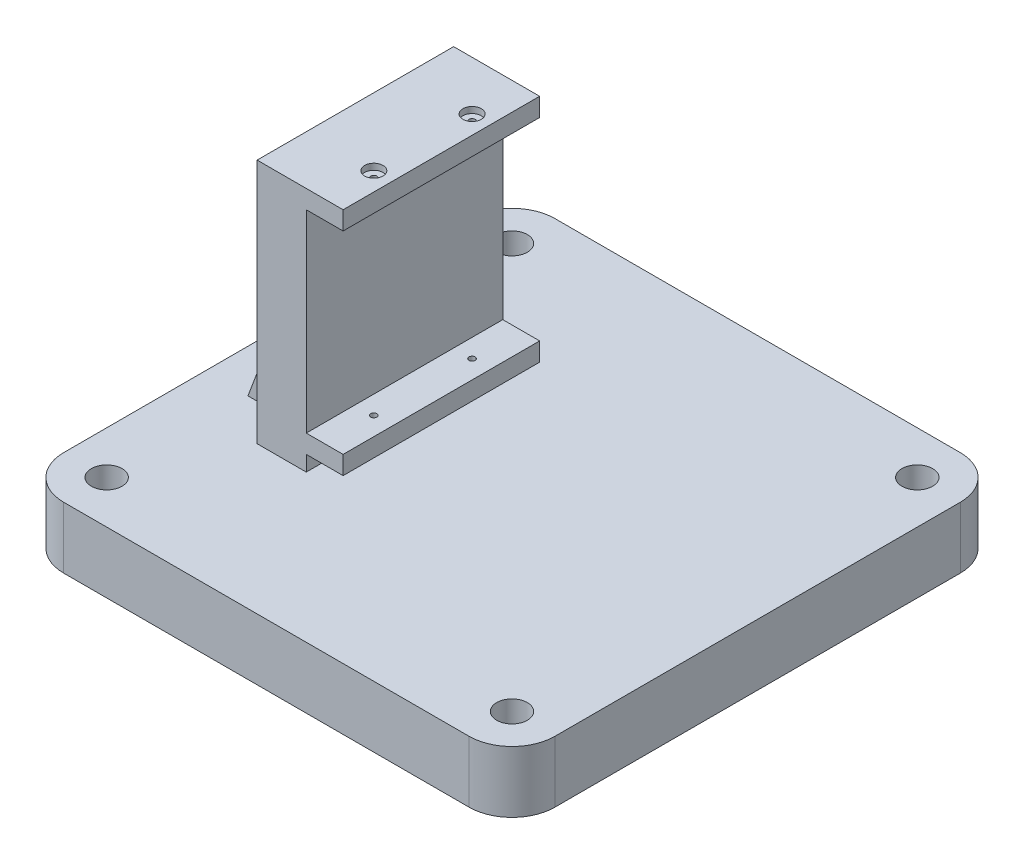
ISO-10303-21;
HEADER;
FILE_DESCRIPTION(('STEP AP214'),'2;1');
FILE_NAME('part.step','',(''),(''),'','','');
FILE_SCHEMA(('AUTOMOTIVE_DESIGN { 1 0 10303 214 1 1 1 1 }'));
ENDSEC;
DATA;
#1=APPLICATION_CONTEXT('core data for automotive mechanical design processes');
#2=APPLICATION_PROTOCOL_DEFINITION('international standard','automotive_design',2000,#1);
#3=PRODUCT_CONTEXT('',#1,'mechanical');
#4=PRODUCT('Part','Part','',(#3));
#5=PRODUCT_RELATED_PRODUCT_CATEGORY('part','',(#4));
#6=PRODUCT_DEFINITION_FORMATION('','',#4);
#7=PRODUCT_DEFINITION_CONTEXT('part definition',#1,'design');
#8=PRODUCT_DEFINITION('design','',#6,#7);
#9=PRODUCT_DEFINITION_SHAPE('','',#8);
#10=(LENGTH_UNIT() NAMED_UNIT(*) SI_UNIT(.MILLI.,.METRE.));
#11=(NAMED_UNIT(*) PLANE_ANGLE_UNIT() SI_UNIT($,.RADIAN.));
#12=(NAMED_UNIT(*) SI_UNIT($,.STERADIAN.) SOLID_ANGLE_UNIT());
#13=UNCERTAINTY_MEASURE_WITH_UNIT(LENGTH_MEASURE(1.E-05),#10,'distance_accuracy_value','');
#14=(GEOMETRIC_REPRESENTATION_CONTEXT(3) GLOBAL_UNCERTAINTY_ASSIGNED_CONTEXT((#13)) GLOBAL_UNIT_ASSIGNED_CONTEXT((#10,
#11,#12)) REPRESENTATION_CONTEXT('',''));
#15=CARTESIAN_POINT('',(0.,0.,0.));
#16=DIRECTION('',(0.,0.,1.));
#17=DIRECTION('',(1.,0.,0.));
#18=AXIS2_PLACEMENT_3D('',#15,#16,#17);
#19=CARTESIAN_POINT('',(-14.5,11.,-8.));
#20=DIRECTION('',(0.,1.,0.));
#21=DIRECTION('',(0.,0.,1.));
#22=AXIS2_PLACEMENT_3D('',#19,#20,#21);
#23=CYLINDRICAL_SURFACE('',#22,0.500000000000001);
#24=CARTESIAN_POINT('',(-14.5,47.,-8.));
#25=DIRECTION('',(0.,1.,0.));
#26=DIRECTION('',(0.,0.,1.));
#27=AXIS2_PLACEMENT_3D('',#24,#25,#26);
#28=CIRCLE('',#27,0.500000000000001);
#29=CARTESIAN_POINT('',(-14.5,47.,-7.5));
#30=VERTEX_POINT('',#29);
#31=EDGE_CURVE('E428',#30,#30,#28,.T.);
#32=ORIENTED_EDGE('',*,*,#31,.F.);
#33=EDGE_LOOP('',(#32));
#34=FACE_BOUND('',#33,.T.);
#35=CARTESIAN_POINT('',(-14.5,49.,-8.));
#36=DIRECTION('',(0.,1.,0.));
#37=DIRECTION('',(0.,0.,1.));
#38=AXIS2_PLACEMENT_3D('',#35,#36,#37);
#39=CIRCLE('',#38,0.500000000000001);
#40=CARTESIAN_POINT('',(-14.5,49.,-7.5));
#41=VERTEX_POINT('',#40);
#42=EDGE_CURVE('E43',#41,#41,#39,.F.);
#43=ORIENTED_EDGE('',*,*,#42,.F.);
#44=EDGE_LOOP('',(#43));
#45=FACE_BOUND('',#44,.T.);
#46=ADVANCED_FACE('F39',(#34,#45),#23,.F.);
#47=CARTESIAN_POINT('',(-14.5,11.,8.));
#48=DIRECTION('',(0.,1.,0.));
#49=DIRECTION('',(0.,0.,1.));
#50=AXIS2_PLACEMENT_3D('',#47,#48,#49);
#51=CYLINDRICAL_SURFACE('',#50,0.500000000000001);
#52=CARTESIAN_POINT('',(-14.5,47.,8.));
#53=DIRECTION('',(0.,1.,0.));
#54=DIRECTION('',(0.,0.,1.));
#55=AXIS2_PLACEMENT_3D('',#52,#53,#54);
#56=CIRCLE('',#55,0.500000000000001);
#57=CARTESIAN_POINT('',(-14.5,47.,8.5));
#58=VERTEX_POINT('',#57);
#59=EDGE_CURVE('E464',#58,#58,#56,.T.);
#60=ORIENTED_EDGE('',*,*,#59,.F.);
#61=EDGE_LOOP('',(#60));
#62=FACE_BOUND('',#61,.T.);
#63=CARTESIAN_POINT('',(-14.5,49.,8.));
#64=DIRECTION('',(0.,1.,0.));
#65=DIRECTION('',(0.,0.,1.));
#66=AXIS2_PLACEMENT_3D('',#63,#64,#65);
#67=CIRCLE('',#66,0.500000000000001);
#68=CARTESIAN_POINT('',(-14.5,49.,8.5));
#69=VERTEX_POINT('',#68);
#70=EDGE_CURVE('E429',#69,#69,#67,.F.);
#71=ORIENTED_EDGE('',*,*,#70,.F.);
#72=EDGE_LOOP('',(#71));
#73=FACE_BOUND('',#72,.T.);
#74=ADVANCED_FACE('F539',(#62,#73),#51,.F.);
#75=CARTESIAN_POINT('',(-17.5,50.,16.));
#76=DIRECTION('',(-1.,0.,0.));
#77=DIRECTION('',(0.,0.,1.));
#78=AXIS2_PLACEMENT_3D('',#75,#76,#77);
#79=PLANE('',#78);
#80=DIRECTION('',(0.,0.,-1.));
#81=VECTOR('',#80,1.);
#82=CARTESIAN_POINT('',(-17.5,12.5,16.));
#83=LINE('',#82,#81);
#84=CARTESIAN_POINT('',(-17.5,12.5,16.));
#85=VERTEX_POINT('',#84);
#86=CARTESIAN_POINT('',(-17.5,12.5,-16.));
#87=VERTEX_POINT('',#86);
#88=EDGE_CURVE('E467',#85,#87,#83,.T.);
#89=ORIENTED_EDGE('',*,*,#88,.F.);
#90=DIRECTION('',(0.,-1.,0.));
#91=VECTOR('',#90,1.);
#92=CARTESIAN_POINT('',(-17.5,50.,16.));
#93=LINE('',#92,#91);
#94=CARTESIAN_POINT('',(-17.5,10.,16.));
#95=VERTEX_POINT('',#94);
#96=EDGE_CURVE('E211',#85,#95,#93,.T.);
#97=ORIENTED_EDGE('',*,*,#96,.T.);
#98=DIRECTION('',(0.,0.,-1.));
#99=VECTOR('',#98,1.);
#100=CARTESIAN_POINT('',(-17.5,10.,16.));
#101=LINE('',#100,#99);
#102=CARTESIAN_POINT('',(-17.5,10.,-16.));
#103=VERTEX_POINT('',#102);
#104=EDGE_CURVE('E287',#95,#103,#101,.T.);
#105=ORIENTED_EDGE('',*,*,#104,.T.);
#106=DIRECTION('',(0.,-1.,0.));
#107=VECTOR('',#106,1.);
#108=CARTESIAN_POINT('',(-17.5,50.,-16.));
#109=LINE('',#108,#107);
#110=EDGE_CURVE('E57',#87,#103,#109,.T.);
#111=ORIENTED_EDGE('',*,*,#110,.F.);
#112=EDGE_LOOP('',(#89,#97,#105,#111));
#113=FACE_BOUND('',#112,.T.);
#114=ADVANCED_FACE('F515',(#113),#79,.F.);
#115=DIRECTION('',(0.,0.,1.));
#116=VECTOR('',#115,1.);
#117=CARTESIAN_POINT('',(-17.5,15.5,16.));
#118=LINE('',#117,#116);
#119=CARTESIAN_POINT('',(-17.5,15.5,-16.));
#120=VERTEX_POINT('',#119);
#121=CARTESIAN_POINT('',(-17.5,15.5,16.));
#122=VERTEX_POINT('',#121);
#123=EDGE_CURVE('E65',#120,#122,#118,.T.);
#124=ORIENTED_EDGE('',*,*,#123,.F.);
#125=CARTESIAN_POINT('',(-17.5,47.,-16.));
#126=VERTEX_POINT('',#125);
#127=EDGE_CURVE('E308',#126,#120,#109,.T.);
#128=ORIENTED_EDGE('',*,*,#127,.F.);
#129=DIRECTION('',(0.,0.,-1.));
#130=VECTOR('',#129,1.);
#131=CARTESIAN_POINT('',(-17.5,47.,16.));
#132=LINE('',#131,#130);
#133=CARTESIAN_POINT('',(-17.5,47.,16.));
#134=VERTEX_POINT('',#133);
#135=EDGE_CURVE('E213',#134,#126,#132,.T.);
#136=ORIENTED_EDGE('',*,*,#135,.F.);
#137=EDGE_CURVE('E305',#134,#122,#93,.T.);
#138=ORIENTED_EDGE('',*,*,#137,.T.);
#139=EDGE_LOOP('',(#124,#128,#136,#138));
#140=FACE_BOUND('',#139,.T.);
#141=ADVANCED_FACE('F490',(#140),#79,.F.);
#142=CARTESIAN_POINT('',(33.,10.,33.));
#143=DIRECTION('',(0.,1.,0.));
#144=DIRECTION('',(0.,0.,1.));
#145=AXIS2_PLACEMENT_3D('',#142,#143,#144);
#146=PLANE('',#145);
#147=DIRECTION('',(1.,0.,0.));
#148=VECTOR('',#147,1.);
#149=CARTESIAN_POINT('',(-25.5,10.,10.));
#150=LINE('',#149,#148);
#151=CARTESIAN_POINT('',(-33.,10.,10.));
#152=VERTEX_POINT('',#151);
#153=CARTESIAN_POINT('',(-25.5,10.,10.));
#154=VERTEX_POINT('',#153);
#155=EDGE_CURVE('E245',#152,#154,#150,.T.);
#156=ORIENTED_EDGE('',*,*,#155,.F.);
#157=DIRECTION('',(0.,0.,-1.));
#158=VECTOR('',#157,1.);
#159=CARTESIAN_POINT('',(-33.,10.,10.));
#160=LINE('',#159,#158);
#161=CARTESIAN_POINT('',(-33.,10.,-10.));
#162=VERTEX_POINT('',#161);
#163=EDGE_CURVE('E255',#152,#162,#160,.T.);
#164=ORIENTED_EDGE('',*,*,#163,.T.);
#165=DIRECTION('',(1.,0.,0.));
#166=VECTOR('',#165,1.);
#167=CARTESIAN_POINT('',(-25.5,10.,-10.));
#168=LINE('',#167,#166);
#169=CARTESIAN_POINT('',(-25.5,10.,-10.));
#170=VERTEX_POINT('',#169);
#171=EDGE_CURVE('E244',#162,#170,#168,.T.);
#172=ORIENTED_EDGE('',*,*,#171,.T.);
#173=DIRECTION('',(0.,0.,-1.));
#174=VECTOR('',#173,1.);
#175=CARTESIAN_POINT('',(-25.5,10.,16.));
#176=LINE('',#175,#174);
#177=CARTESIAN_POINT('',(-25.5,10.,-16.));
#178=VERTEX_POINT('',#177);
#179=EDGE_CURVE('E293',#170,#178,#176,.T.);
#180=ORIENTED_EDGE('',*,*,#179,.T.);
#181=DIRECTION('',(1.,0.,0.));
#182=VECTOR('',#181,1.);
#183=CARTESIAN_POINT('',(-25.5,10.,-16.));
#184=LINE('',#183,#182);
#185=EDGE_CURVE('E272',#178,#103,#184,.T.);
#186=ORIENTED_EDGE('',*,*,#185,.T.);
#187=ORIENTED_EDGE('',*,*,#104,.F.);
#188=DIRECTION('',(1.,0.,0.));
#189=VECTOR('',#188,1.);
#190=CARTESIAN_POINT('',(-25.5,10.,16.));
#191=LINE('',#190,#189);
#192=CARTESIAN_POINT('',(-25.5,10.,16.));
#193=VERTEX_POINT('',#192);
#194=EDGE_CURVE('E290',#193,#95,#191,.T.);
#195=ORIENTED_EDGE('',*,*,#194,.F.);
#196=EDGE_CURVE('E277',#193,#154,#176,.T.);
#197=ORIENTED_EDGE('',*,*,#196,.T.);
#198=EDGE_LOOP('',(#156,#164,#172,#180,#186,#187,#195,#197));
#199=FACE_BOUND('',#198,.T.);
#200=CARTESIAN_POINT('',(33.,10.,-33.));
#201=DIRECTION('',(0.,1.,0.));
#202=DIRECTION('',(0.,0.,-1.));
#203=AXIS2_PLACEMENT_3D('',#200,#201,#202);
#204=CIRCLE('',#203,2.5);
#205=CARTESIAN_POINT('',(33.,10.,-35.5));
#206=VERTEX_POINT('',#205);
#207=EDGE_CURVE('E319',#206,#206,#204,.T.);
#208=ORIENTED_EDGE('',*,*,#207,.F.);
#209=EDGE_LOOP('',(#208));
#210=FACE_BOUND('',#209,.T.);
#211=CARTESIAN_POINT('',(33.,10.,33.));
#212=DIRECTION('',(0.,1.,0.));
#213=DIRECTION('',(0.,0.,1.));
#214=AXIS2_PLACEMENT_3D('',#211,#212,#213);
#215=CIRCLE('',#214,2.5);
#216=CARTESIAN_POINT('',(33.,10.,35.5));
#217=VERTEX_POINT('',#216);
#218=EDGE_CURVE('E335',#217,#217,#215,.T.);
#219=ORIENTED_EDGE('',*,*,#218,.F.);
#220=EDGE_LOOP('',(#219));
#221=FACE_BOUND('',#220,.T.);
#222=CARTESIAN_POINT('',(33.,10.,33.));
#223=DIRECTION('',(0.,1.,0.));
#224=DIRECTION('',(0.,0.,1.));
#225=AXIS2_PLACEMENT_3D('',#222,#223,#224);
#226=CIRCLE('',#225,7.);
#227=CARTESIAN_POINT('',(33.,10.,40.));
#228=VERTEX_POINT('',#227);
#229=CARTESIAN_POINT('',(40.,10.,33.));
#230=VERTEX_POINT('',#229);
#231=EDGE_CURVE('E343',#228,#230,#226,.T.);
#232=ORIENTED_EDGE('',*,*,#231,.T.);
#233=DIRECTION('',(0.,0.,-1.));
#234=VECTOR('',#233,1.);
#235=CARTESIAN_POINT('',(40.,10.,33.));
#236=LINE('',#235,#234);
#237=CARTESIAN_POINT('',(40.,10.,-33.));
#238=VERTEX_POINT('',#237);
#239=EDGE_CURVE('E347',#230,#238,#236,.T.);
#240=ORIENTED_EDGE('',*,*,#239,.T.);
#241=CARTESIAN_POINT('',(33.,10.,-33.));
#242=DIRECTION('',(0.,1.,0.));
#243=DIRECTION('',(0.,0.,-1.));
#244=AXIS2_PLACEMENT_3D('',#241,#242,#243);
#245=CIRCLE('',#244,7.);
#246=CARTESIAN_POINT('',(33.,10.,-40.));
#247=VERTEX_POINT('',#246);
#248=EDGE_CURVE('E351',#238,#247,#245,.T.);
#249=ORIENTED_EDGE('',*,*,#248,.T.);
#250=DIRECTION('',(-1.,0.,0.));
#251=VECTOR('',#250,1.);
#252=CARTESIAN_POINT('',(-33.,10.,-40.));
#253=LINE('',#252,#251);
#254=CARTESIAN_POINT('',(-33.,10.,-40.));
#255=VERTEX_POINT('',#254);
#256=EDGE_CURVE('E354',#247,#255,#253,.T.);
#257=ORIENTED_EDGE('',*,*,#256,.T.);
#258=CARTESIAN_POINT('',(-33.,10.,-33.));
#259=DIRECTION('',(0.,1.,0.));
#260=DIRECTION('',(0.,0.,1.));
#261=AXIS2_PLACEMENT_3D('',#258,#259,#260);
#262=CIRCLE('',#261,7.);
#263=CARTESIAN_POINT('',(-40.,10.,-33.));
#264=VERTEX_POINT('',#263);
#265=EDGE_CURVE('E357',#255,#264,#262,.T.);
#266=ORIENTED_EDGE('',*,*,#265,.T.);
#267=DIRECTION('',(0.,0.,1.));
#268=VECTOR('',#267,1.);
#269=CARTESIAN_POINT('',(-40.,10.,33.));
#270=LINE('',#269,#268);
#271=CARTESIAN_POINT('',(-40.,10.,33.));
#272=VERTEX_POINT('',#271);
#273=EDGE_CURVE('E360',#264,#272,#270,.T.);
#274=ORIENTED_EDGE('',*,*,#273,.T.);
#275=CARTESIAN_POINT('',(-33.,10.,33.));
#276=DIRECTION('',(0.,1.,0.));
#277=DIRECTION('',(0.,0.,-1.));
#278=AXIS2_PLACEMENT_3D('',#275,#276,#277);
#279=CIRCLE('',#278,7.);
#280=CARTESIAN_POINT('',(-33.,10.,40.));
#281=VERTEX_POINT('',#280);
#282=EDGE_CURVE('E363',#272,#281,#279,.T.);
#283=ORIENTED_EDGE('',*,*,#282,.T.);
#284=DIRECTION('',(1.,0.,0.));
#285=VECTOR('',#284,1.);
#286=CARTESIAN_POINT('',(-33.,10.,40.));
#287=LINE('',#286,#285);
#288=EDGE_CURVE('E366',#281,#228,#287,.T.);
#289=ORIENTED_EDGE('',*,*,#288,.T.);
#290=EDGE_LOOP('',(#232,#240,#249,#257,#266,#274,#283,#289));
#291=FACE_BOUND('',#290,.T.);
#292=CARTESIAN_POINT('',(-33.,10.,33.));
#293=DIRECTION('',(0.,1.,0.));
#294=DIRECTION('',(0.,0.,-1.));
#295=AXIS2_PLACEMENT_3D('',#292,#293,#294);
#296=CIRCLE('',#295,2.5);
#297=CARTESIAN_POINT('',(-33.,10.,30.5));
#298=VERTEX_POINT('',#297);
#299=EDGE_CURVE('E327',#298,#298,#296,.T.);
#300=ORIENTED_EDGE('',*,*,#299,.F.);
#301=EDGE_LOOP('',(#300));
#302=FACE_BOUND('',#301,.T.);
#303=CARTESIAN_POINT('',(-33.,10.,-33.));
#304=DIRECTION('',(0.,1.,0.));
#305=DIRECTION('',(0.,0.,1.));
#306=AXIS2_PLACEMENT_3D('',#303,#304,#305);
#307=CIRCLE('',#306,2.5);
#308=CARTESIAN_POINT('',(-33.,10.,-30.5));
#309=VERTEX_POINT('',#308);
#310=EDGE_CURVE('E311',#309,#309,#307,.T.);
#311=ORIENTED_EDGE('',*,*,#310,.F.);
#312=EDGE_LOOP('',(#311));
#313=FACE_BOUND('',#312,.T.);
#314=ADVANCED_FACE('F513',(#199,#210,#221,#291,#302,#313),#146,.T.);
#315=CARTESIAN_POINT('',(33.,0.,33.));
#316=DIRECTION('',(0.,1.,0.));
#317=DIRECTION('',(0.,0.,1.));
#318=AXIS2_PLACEMENT_3D('',#315,#316,#317);
#319=PLANE('',#318);
#320=CARTESIAN_POINT('',(33.,0.,33.));
#321=DIRECTION('',(0.,1.,0.));
#322=DIRECTION('',(0.,0.,1.));
#323=AXIS2_PLACEMENT_3D('',#320,#321,#322);
#324=CIRCLE('',#323,7.);
#325=CARTESIAN_POINT('',(33.,0.,40.));
#326=VERTEX_POINT('',#325);
#327=CARTESIAN_POINT('',(40.,0.,33.));
#328=VERTEX_POINT('',#327);
#329=EDGE_CURVE('E339',#326,#328,#324,.T.);
#330=ORIENTED_EDGE('',*,*,#329,.F.);
#331=DIRECTION('',(1.,0.,0.));
#332=VECTOR('',#331,1.);
#333=CARTESIAN_POINT('',(-33.,0.,40.));
#334=LINE('',#333,#332);
#335=CARTESIAN_POINT('',(-33.,0.,40.));
#336=VERTEX_POINT('',#335);
#337=EDGE_CURVE('E348',#336,#326,#334,.T.);
#338=ORIENTED_EDGE('',*,*,#337,.F.);
#339=CARTESIAN_POINT('',(-33.,0.,33.));
#340=DIRECTION('',(0.,1.,0.));
#341=DIRECTION('',(0.,0.,-1.));
#342=AXIS2_PLACEMENT_3D('',#339,#340,#341);
#343=CIRCLE('',#342,7.);
#344=CARTESIAN_POINT('',(-40.,0.,33.));
#345=VERTEX_POINT('',#344);
#346=EDGE_CURVE('E388',#345,#336,#343,.T.);
#347=ORIENTED_EDGE('',*,*,#346,.F.);
#348=DIRECTION('',(0.,0.,1.));
#349=VECTOR('',#348,1.);
#350=CARTESIAN_POINT('',(-40.,0.,33.));
#351=LINE('',#350,#349);
#352=CARTESIAN_POINT('',(-40.,0.,-33.));
#353=VERTEX_POINT('',#352);
#354=EDGE_CURVE('E385',#353,#345,#351,.T.);
#355=ORIENTED_EDGE('',*,*,#354,.F.);
#356=CARTESIAN_POINT('',(-33.,0.,-33.));
#357=DIRECTION('',(0.,1.,0.));
#358=DIRECTION('',(0.,0.,1.));
#359=AXIS2_PLACEMENT_3D('',#356,#357,#358);
#360=CIRCLE('',#359,7.);
#361=CARTESIAN_POINT('',(-33.,0.,-40.));
#362=VERTEX_POINT('',#361);
#363=EDGE_CURVE('E382',#362,#353,#360,.T.);
#364=ORIENTED_EDGE('',*,*,#363,.F.);
#365=DIRECTION('',(-1.,0.,0.));
#366=VECTOR('',#365,1.);
#367=CARTESIAN_POINT('',(-33.,0.,-40.));
#368=LINE('',#367,#366);
#369=CARTESIAN_POINT('',(33.,0.,-40.));
#370=VERTEX_POINT('',#369);
#371=EDGE_CURVE('E379',#370,#362,#368,.T.);
#372=ORIENTED_EDGE('',*,*,#371,.F.);
#373=CARTESIAN_POINT('',(33.,0.,-33.));
#374=DIRECTION('',(0.,1.,0.));
#375=DIRECTION('',(0.,0.,-1.));
#376=AXIS2_PLACEMENT_3D('',#373,#374,#375);
#377=CIRCLE('',#376,7.);
#378=CARTESIAN_POINT('',(40.,0.,-33.));
#379=VERTEX_POINT('',#378);
#380=EDGE_CURVE('E376',#379,#370,#377,.T.);
#381=ORIENTED_EDGE('',*,*,#380,.F.);
#382=DIRECTION('',(0.,0.,-1.));
#383=VECTOR('',#382,1.);
#384=CARTESIAN_POINT('',(40.,0.,33.));
#385=LINE('',#384,#383);
#386=EDGE_CURVE('E373',#328,#379,#385,.T.);
#387=ORIENTED_EDGE('',*,*,#386,.F.);
#388=EDGE_LOOP('',(#330,#338,#347,#355,#364,#372,#381,#387));
#389=FACE_BOUND('',#388,.T.);
#390=CARTESIAN_POINT('',(33.,0.,33.));
#391=DIRECTION('',(0.,1.,0.));
#392=DIRECTION('',(0.,0.,1.));
#393=AXIS2_PLACEMENT_3D('',#390,#391,#392);
#394=CIRCLE('',#393,2.5);
#395=CARTESIAN_POINT('',(33.,0.,35.5));
#396=VERTEX_POINT('',#395);
#397=EDGE_CURVE('E331',#396,#396,#394,.T.);
#398=ORIENTED_EDGE('',*,*,#397,.T.);
#399=EDGE_LOOP('',(#398));
#400=FACE_BOUND('',#399,.T.);
#401=CARTESIAN_POINT('',(-33.,0.,33.));
#402=DIRECTION('',(0.,1.,0.));
#403=DIRECTION('',(0.,0.,-1.));
#404=AXIS2_PLACEMENT_3D('',#401,#402,#403);
#405=CIRCLE('',#404,2.5);
#406=CARTESIAN_POINT('',(-33.,0.,30.5));
#407=VERTEX_POINT('',#406);
#408=EDGE_CURVE('E323',#407,#407,#405,.T.);
#409=ORIENTED_EDGE('',*,*,#408,.T.);
#410=EDGE_LOOP('',(#409));
#411=FACE_BOUND('',#410,.T.);
#412=CARTESIAN_POINT('',(33.,0.,-33.));
#413=DIRECTION('',(0.,1.,0.));
#414=DIRECTION('',(0.,0.,-1.));
#415=AXIS2_PLACEMENT_3D('',#412,#413,#414);
#416=CIRCLE('',#415,2.5);
#417=CARTESIAN_POINT('',(33.,0.,-35.5));
#418=VERTEX_POINT('',#417);
#419=EDGE_CURVE('E315',#418,#418,#416,.T.);
#420=ORIENTED_EDGE('',*,*,#419,.T.);
#421=EDGE_LOOP('',(#420));
#422=FACE_BOUND('',#421,.T.);
#423=CARTESIAN_POINT('',(-33.,0.,-33.));
#424=DIRECTION('',(0.,1.,0.));
#425=DIRECTION('',(0.,0.,1.));
#426=AXIS2_PLACEMENT_3D('',#423,#424,#425);
#427=CIRCLE('',#426,2.5);
#428=CARTESIAN_POINT('',(-33.,0.,-30.5));
#429=VERTEX_POINT('',#428);
#430=EDGE_CURVE('E301',#429,#429,#427,.T.);
#431=ORIENTED_EDGE('',*,*,#430,.T.);
#432=EDGE_LOOP('',(#431));
#433=FACE_BOUND('',#432,.T.);
#434=ADVANCED_FACE('F755',(#389,#400,#411,#422,#433),#319,.F.);
#435=CARTESIAN_POINT('',(33.,10.,33.));
#436=DIRECTION('',(0.,-1.,0.));
#437=DIRECTION('',(0.,0.,-1.));
#438=AXIS2_PLACEMENT_3D('',#435,#436,#437);
#439=CYLINDRICAL_SURFACE('',#438,7.);
#440=ORIENTED_EDGE('',*,*,#329,.T.);
#441=DIRECTION('',(0.,-1.,0.));
#442=VECTOR('',#441,1.);
#443=CARTESIAN_POINT('',(40.,10.,33.));
#444=LINE('',#443,#442);
#445=EDGE_CURVE('E11',#230,#328,#444,.T.);
#446=ORIENTED_EDGE('',*,*,#445,.F.);
#447=ORIENTED_EDGE('',*,*,#231,.F.);
#448=DIRECTION('',(0.,-1.,0.));
#449=VECTOR('',#448,1.);
#450=CARTESIAN_POINT('',(33.,10.,40.));
#451=LINE('',#450,#449);
#452=EDGE_CURVE('E369',#228,#326,#451,.T.);
#453=ORIENTED_EDGE('',*,*,#452,.T.);
#454=EDGE_LOOP('',(#440,#446,#447,#453));
#455=FACE_BOUND('',#454,.T.);
#456=ADVANCED_FACE('F41',(#455),#439,.T.);
#457=CARTESIAN_POINT('',(40.,10.,33.));
#458=DIRECTION('',(-1.,0.,0.));
#459=DIRECTION('',(0.,0.,1.));
#460=AXIS2_PLACEMENT_3D('',#457,#458,#459);
#461=PLANE('',#460);
#462=ORIENTED_EDGE('',*,*,#386,.T.);
#463=DIRECTION('',(0.,-1.,0.));
#464=VECTOR('',#463,1.);
#465=CARTESIAN_POINT('',(40.,10.,-33.));
#466=LINE('',#465,#464);
#467=EDGE_CURVE('E49',#238,#379,#466,.T.);
#468=ORIENTED_EDGE('',*,*,#467,.F.);
#469=ORIENTED_EDGE('',*,*,#239,.F.);
#470=ORIENTED_EDGE('',*,*,#445,.T.);
#471=EDGE_LOOP('',(#462,#468,#469,#470));
#472=FACE_BOUND('',#471,.T.);
#473=ADVANCED_FACE('F780',(#472),#461,.F.);
#474=CARTESIAN_POINT('',(33.,10.,-33.));
#475=DIRECTION('',(0.,-1.,0.));
#476=DIRECTION('',(0.,0.,-1.));
#477=AXIS2_PLACEMENT_3D('',#474,#475,#476);
#478=CYLINDRICAL_SURFACE('',#477,7.);
#479=ORIENTED_EDGE('',*,*,#380,.T.);
#480=DIRECTION('',(0.,-1.,0.));
#481=VECTOR('',#480,1.);
#482=CARTESIAN_POINT('',(33.,10.,-40.));
#483=LINE('',#482,#481);
#484=EDGE_CURVE('E412',#247,#370,#483,.T.);
#485=ORIENTED_EDGE('',*,*,#484,.F.);
#486=ORIENTED_EDGE('',*,*,#248,.F.);
#487=ORIENTED_EDGE('',*,*,#467,.T.);
#488=EDGE_LOOP('',(#479,#485,#486,#487));
#489=FACE_BOUND('',#488,.T.);
#490=ADVANCED_FACE('F777',(#489),#478,.T.);
#491=CARTESIAN_POINT('',(-33.,10.,-40.));
#492=DIRECTION('',(0.,0.,1.));
#493=DIRECTION('',(1.,0.,0.));
#494=AXIS2_PLACEMENT_3D('',#491,#492,#493);
#495=PLANE('',#494);
#496=ORIENTED_EDGE('',*,*,#371,.T.);
#497=DIRECTION('',(0.,-1.,0.));
#498=VECTOR('',#497,1.);
#499=CARTESIAN_POINT('',(-33.,10.,-40.));
#500=LINE('',#499,#498);
#501=EDGE_CURVE('E408',#255,#362,#500,.T.);
#502=ORIENTED_EDGE('',*,*,#501,.F.);
#503=ORIENTED_EDGE('',*,*,#256,.F.);
#504=ORIENTED_EDGE('',*,*,#484,.T.);
#505=EDGE_LOOP('',(#496,#502,#503,#504));
#506=FACE_BOUND('',#505,.T.);
#507=ADVANCED_FACE('F773',(#506),#495,.F.);
#508=CARTESIAN_POINT('',(-33.,10.,-33.));
#509=DIRECTION('',(0.,-1.,0.));
#510=DIRECTION('',(0.,0.,-1.));
#511=AXIS2_PLACEMENT_3D('',#508,#509,#510);
#512=CYLINDRICAL_SURFACE('',#511,7.);
#513=ORIENTED_EDGE('',*,*,#363,.T.);
#514=DIRECTION('',(0.,-1.,0.));
#515=VECTOR('',#514,1.);
#516=CARTESIAN_POINT('',(-40.,10.,-33.));
#517=LINE('',#516,#515);
#518=EDGE_CURVE('E404',#264,#353,#517,.T.);
#519=ORIENTED_EDGE('',*,*,#518,.F.);
#520=ORIENTED_EDGE('',*,*,#265,.F.);
#521=ORIENTED_EDGE('',*,*,#501,.T.);
#522=EDGE_LOOP('',(#513,#519,#520,#521));
#523=FACE_BOUND('',#522,.T.);
#524=ADVANCED_FACE('F769',(#523),#512,.T.);
#525=CARTESIAN_POINT('',(-40.,10.,33.));
#526=DIRECTION('',(1.,0.,0.));
#527=DIRECTION('',(0.,0.,-1.));
#528=AXIS2_PLACEMENT_3D('',#525,#526,#527);
#529=PLANE('',#528);
#530=ORIENTED_EDGE('',*,*,#354,.T.);
#531=DIRECTION('',(0.,-1.,0.));
#532=VECTOR('',#531,1.);
#533=CARTESIAN_POINT('',(-40.,10.,33.));
#534=LINE('',#533,#532);
#535=EDGE_CURVE('E400',#272,#345,#534,.T.);
#536=ORIENTED_EDGE('',*,*,#535,.F.);
#537=ORIENTED_EDGE('',*,*,#273,.F.);
#538=ORIENTED_EDGE('',*,*,#518,.T.);
#539=EDGE_LOOP('',(#530,#536,#537,#538));
#540=FACE_BOUND('',#539,.T.);
#541=ADVANCED_FACE('F765',(#540),#529,.F.);
#542=CARTESIAN_POINT('',(-33.,10.,33.));
#543=DIRECTION('',(0.,-1.,0.));
#544=DIRECTION('',(0.,0.,-1.));
#545=AXIS2_PLACEMENT_3D('',#542,#543,#544);
#546=CYLINDRICAL_SURFACE('',#545,7.);
#547=ORIENTED_EDGE('',*,*,#346,.T.);
#548=DIRECTION('',(0.,-1.,0.));
#549=VECTOR('',#548,1.);
#550=CARTESIAN_POINT('',(-33.,10.,40.));
#551=LINE('',#550,#549);
#552=EDGE_CURVE('E396',#281,#336,#551,.T.);
#553=ORIENTED_EDGE('',*,*,#552,.F.);
#554=ORIENTED_EDGE('',*,*,#282,.F.);
#555=ORIENTED_EDGE('',*,*,#535,.T.);
#556=EDGE_LOOP('',(#547,#553,#554,#555));
#557=FACE_BOUND('',#556,.T.);
#558=ADVANCED_FACE('F761',(#557),#546,.T.);
#559=CARTESIAN_POINT('',(-33.,10.,40.));
#560=DIRECTION('',(0.,0.,-1.));
#561=DIRECTION('',(-1.,0.,0.));
#562=AXIS2_PLACEMENT_3D('',#559,#560,#561);
#563=PLANE('',#562);
#564=ORIENTED_EDGE('',*,*,#337,.T.);
#565=ORIENTED_EDGE('',*,*,#452,.F.);
#566=ORIENTED_EDGE('',*,*,#288,.F.);
#567=ORIENTED_EDGE('',*,*,#552,.T.);
#568=EDGE_LOOP('',(#564,#565,#566,#567));
#569=FACE_BOUND('',#568,.T.);
#570=ADVANCED_FACE('F752',(#569),#563,.F.);
#571=CARTESIAN_POINT('',(33.,10.,33.));
#572=DIRECTION('',(0.,-1.,0.));
#573=DIRECTION('',(0.,0.,-1.));
#574=AXIS2_PLACEMENT_3D('',#571,#572,#573);
#575=CYLINDRICAL_SURFACE('',#574,2.5);
#576=ORIENTED_EDGE('',*,*,#218,.T.);
#577=EDGE_LOOP('',(#576));
#578=FACE_BOUND('',#577,.T.);
#579=ORIENTED_EDGE('',*,*,#397,.F.);
#580=EDGE_LOOP('',(#579));
#581=FACE_BOUND('',#580,.T.);
#582=ADVANCED_FACE('F748',(#578,#581),#575,.F.);
#583=CARTESIAN_POINT('',(-33.,10.,33.));
#584=DIRECTION('',(0.,-1.,0.));
#585=DIRECTION('',(0.,0.,-1.));
#586=AXIS2_PLACEMENT_3D('',#583,#584,#585);
#587=CYLINDRICAL_SURFACE('',#586,2.5);
#588=ORIENTED_EDGE('',*,*,#299,.T.);
#589=EDGE_LOOP('',(#588));
#590=FACE_BOUND('',#589,.T.);
#591=ORIENTED_EDGE('',*,*,#408,.F.);
#592=EDGE_LOOP('',(#591));
#593=FACE_BOUND('',#592,.T.);
#594=ADVANCED_FACE('F744',(#590,#593),#587,.F.);
#595=CARTESIAN_POINT('',(33.,10.,-33.));
#596=DIRECTION('',(0.,-1.,0.));
#597=DIRECTION('',(0.,0.,-1.));
#598=AXIS2_PLACEMENT_3D('',#595,#596,#597);
#599=CYLINDRICAL_SURFACE('',#598,2.5);
#600=ORIENTED_EDGE('',*,*,#207,.T.);
#601=EDGE_LOOP('',(#600));
#602=FACE_BOUND('',#601,.T.);
#603=ORIENTED_EDGE('',*,*,#419,.F.);
#604=EDGE_LOOP('',(#603));
#605=FACE_BOUND('',#604,.T.);
#606=ADVANCED_FACE('F741',(#602,#605),#599,.F.);
#607=CARTESIAN_POINT('',(-33.,10.,-33.));
#608=DIRECTION('',(0.,-1.,0.));
#609=DIRECTION('',(0.,0.,-1.));
#610=AXIS2_PLACEMENT_3D('',#607,#608,#609);
#611=CYLINDRICAL_SURFACE('',#610,2.5);
#612=ORIENTED_EDGE('',*,*,#310,.T.);
#613=EDGE_LOOP('',(#612));
#614=FACE_BOUND('',#613,.T.);
#615=ORIENTED_EDGE('',*,*,#430,.F.);
#616=EDGE_LOOP('',(#615));
#617=FACE_BOUND('',#616,.T.);
#618=ADVANCED_FACE('F726',(#614,#617),#611,.F.);
#619=CARTESIAN_POINT('',(-25.5,50.,-16.));
#620=DIRECTION('',(0.,0.,-1.));
#621=DIRECTION('',(-1.,0.,0.));
#622=AXIS2_PLACEMENT_3D('',#619,#620,#621);
#623=PLANE('',#622);
#624=ORIENTED_EDGE('',*,*,#185,.F.);
#625=DIRECTION('',(0.,-1.,0.));
#626=VECTOR('',#625,1.);
#627=CARTESIAN_POINT('',(-25.5,50.,-16.));
#628=LINE('',#627,#626);
#629=CARTESIAN_POINT('',(-25.5,50.,-16.));
#630=VERTEX_POINT('',#629);
#631=EDGE_CURVE('E297',#630,#178,#628,.T.);
#632=ORIENTED_EDGE('',*,*,#631,.F.);
#633=DIRECTION('',(1.,0.,0.));
#634=VECTOR('',#633,1.);
#635=CARTESIAN_POINT('',(-25.5,50.,-16.));
#636=LINE('',#635,#634);
#637=CARTESIAN_POINT('',(-11.5,50.,-16.));
#638=VERTEX_POINT('',#637);
#639=EDGE_CURVE('E273',#630,#638,#636,.T.);
#640=ORIENTED_EDGE('',*,*,#639,.T.);
#641=DIRECTION('',(0.,1.,0.));
#642=VECTOR('',#641,1.);
#643=CARTESIAN_POINT('',(-11.5,50.,-16.));
#644=LINE('',#643,#642);
#645=CARTESIAN_POINT('',(-11.5,47.,-16.));
#646=VERTEX_POINT('',#645);
#647=EDGE_CURVE('E229',#646,#638,#644,.T.);
#648=ORIENTED_EDGE('',*,*,#647,.F.);
#649=DIRECTION('',(-1.,0.,0.));
#650=VECTOR('',#649,1.);
#651=CARTESIAN_POINT('',(-11.5,47.,-16.));
#652=LINE('',#651,#650);
#653=EDGE_CURVE('E236',#646,#126,#652,.T.);
#654=ORIENTED_EDGE('',*,*,#653,.T.);
#655=ORIENTED_EDGE('',*,*,#127,.T.);
#656=DIRECTION('',(-1.,0.,0.));
#657=VECTOR('',#656,1.);
#658=CARTESIAN_POINT('',(-11.5,15.5,-16.));
#659=LINE('',#658,#657);
#660=CARTESIAN_POINT('',(-11.5,15.5,-16.));
#661=VERTEX_POINT('',#660);
#662=EDGE_CURVE('E219',#661,#120,#659,.T.);
#663=ORIENTED_EDGE('',*,*,#662,.F.);
#664=DIRECTION('',(0.,1.,0.));
#665=VECTOR('',#664,1.);
#666=CARTESIAN_POINT('',(-11.5,15.5,-16.));
#667=LINE('',#666,#665);
#668=CARTESIAN_POINT('',(-11.5,12.5,-16.));
#669=VERTEX_POINT('',#668);
#670=EDGE_CURVE('E197',#669,#661,#667,.T.);
#671=ORIENTED_EDGE('',*,*,#670,.F.);
#672=DIRECTION('',(-1.,0.,0.));
#673=VECTOR('',#672,1.);
#674=CARTESIAN_POINT('',(-11.5,12.5,-16.));
#675=LINE('',#674,#673);
#676=EDGE_CURVE('E193',#669,#87,#675,.T.);
#677=ORIENTED_EDGE('',*,*,#676,.T.);
#678=ORIENTED_EDGE('',*,*,#110,.T.);
#679=EDGE_LOOP('',(#624,#632,#640,#648,#654,#655,#663,#671,#677,#678));
#680=FACE_BOUND('',#679,.T.);
#681=ADVANCED_FACE('F486',(#680),#623,.T.);
#682=CARTESIAN_POINT('',(-25.5,50.,16.));
#683=DIRECTION('',(-1.,0.,0.));
#684=DIRECTION('',(0.,0.,1.));
#685=AXIS2_PLACEMENT_3D('',#682,#683,#684);
#686=PLANE('',#685);
#687=DIRECTION('',(0.,1.,0.));
#688=VECTOR('',#687,1.);
#689=CARTESIAN_POINT('',(-25.5,30.,10.));
#690=LINE('',#689,#688);
#691=CARTESIAN_POINT('',(-25.5,30.,10.));
#692=VERTEX_POINT('',#691);
#693=EDGE_CURVE('E248',#154,#692,#690,.T.);
#694=ORIENTED_EDGE('',*,*,#693,.F.);
#695=ORIENTED_EDGE('',*,*,#196,.F.);
#696=DIRECTION('',(0.,-1.,0.));
#697=VECTOR('',#696,1.);
#698=CARTESIAN_POINT('',(-25.5,50.,16.));
#699=LINE('',#698,#697);
#700=CARTESIAN_POINT('',(-25.5,50.,16.));
#701=VERTEX_POINT('',#700);
#702=EDGE_CURVE('E302',#701,#193,#699,.T.);
#703=ORIENTED_EDGE('',*,*,#702,.F.);
#704=DIRECTION('',(0.,0.,-1.));
#705=VECTOR('',#704,1.);
#706=CARTESIAN_POINT('',(-25.5,50.,16.));
#707=LINE('',#706,#705);
#708=EDGE_CURVE('E280',#701,#630,#707,.T.);
#709=ORIENTED_EDGE('',*,*,#708,.T.);
#710=ORIENTED_EDGE('',*,*,#631,.T.);
#711=ORIENTED_EDGE('',*,*,#179,.F.);
#712=DIRECTION('',(0.,1.,0.));
#713=VECTOR('',#712,1.);
#714=CARTESIAN_POINT('',(-25.5,30.,-10.));
#715=LINE('',#714,#713);
#716=CARTESIAN_POINT('',(-25.5,30.,-10.));
#717=VERTEX_POINT('',#716);
#718=EDGE_CURVE('E259',#170,#717,#715,.T.);
#719=ORIENTED_EDGE('',*,*,#718,.T.);
#720=DIRECTION('',(0.,0.,-1.));
#721=VECTOR('',#720,1.);
#722=CARTESIAN_POINT('',(-25.5,30.,10.));
#723=LINE('',#722,#721);
#724=EDGE_CURVE('E268',#692,#717,#723,.T.);
#725=ORIENTED_EDGE('',*,*,#724,.F.);
#726=EDGE_LOOP('',(#694,#695,#703,#709,#710,#711,#719,#725));
#727=FACE_BOUND('',#726,.T.);
#728=ADVANCED_FACE('F509',(#727),#686,.T.);
#729=CARTESIAN_POINT('',(-25.5,50.,16.));
#730=DIRECTION('',(0.,0.,-1.));
#731=DIRECTION('',(-1.,0.,0.));
#732=AXIS2_PLACEMENT_3D('',#729,#730,#731);
#733=PLANE('',#732);
#734=ORIENTED_EDGE('',*,*,#194,.T.);
#735=ORIENTED_EDGE('',*,*,#96,.F.);
#736=DIRECTION('',(-1.,0.,0.));
#737=VECTOR('',#736,1.);
#738=CARTESIAN_POINT('',(-11.5,12.5,16.));
#739=LINE('',#738,#737);
#740=CARTESIAN_POINT('',(-11.5,12.5,16.));
#741=VERTEX_POINT('',#740);
#742=EDGE_CURVE('E191',#741,#85,#739,.T.);
#743=ORIENTED_EDGE('',*,*,#742,.F.);
#744=DIRECTION('',(0.,-1.,0.));
#745=VECTOR('',#744,1.);
#746=CARTESIAN_POINT('',(-11.5,15.5,16.));
#747=LINE('',#746,#745);
#748=CARTESIAN_POINT('',(-11.5,15.5,16.));
#749=VERTEX_POINT('',#748);
#750=EDGE_CURVE('E198',#749,#741,#747,.T.);
#751=ORIENTED_EDGE('',*,*,#750,.F.);
#752=DIRECTION('',(-1.,0.,0.));
#753=VECTOR('',#752,1.);
#754=CARTESIAN_POINT('',(-11.5,15.5,16.));
#755=LINE('',#754,#753);
#756=EDGE_CURVE('E473',#749,#122,#755,.T.);
#757=ORIENTED_EDGE('',*,*,#756,.T.);
#758=ORIENTED_EDGE('',*,*,#137,.F.);
#759=DIRECTION('',(-1.,0.,0.));
#760=VECTOR('',#759,1.);
#761=CARTESIAN_POINT('',(-11.5,47.,16.));
#762=LINE('',#761,#760);
#763=CARTESIAN_POINT('',(-11.5,47.,16.));
#764=VERTEX_POINT('',#763);
#765=EDGE_CURVE('E241',#764,#134,#762,.T.);
#766=ORIENTED_EDGE('',*,*,#765,.F.);
#767=DIRECTION('',(0.,-1.,0.));
#768=VECTOR('',#767,1.);
#769=CARTESIAN_POINT('',(-11.5,50.,16.));
#770=LINE('',#769,#768);
#771=CARTESIAN_POINT('',(-11.5,50.,16.));
#772=VERTEX_POINT('',#771);
#773=EDGE_CURVE('E217',#772,#764,#770,.T.);
#774=ORIENTED_EDGE('',*,*,#773,.F.);
#775=DIRECTION('',(1.,0.,0.));
#776=VECTOR('',#775,1.);
#777=CARTESIAN_POINT('',(-25.5,50.,16.));
#778=LINE('',#777,#776);
#779=EDGE_CURVE('E276',#701,#772,#778,.T.);
#780=ORIENTED_EDGE('',*,*,#779,.F.);
#781=ORIENTED_EDGE('',*,*,#702,.T.);
#782=EDGE_LOOP('',(#734,#735,#743,#751,#757,#758,#766,#774,#780,#781));
#783=FACE_BOUND('',#782,.T.);
#784=ADVANCED_FACE('F210',(#783),#733,.F.);
#785=CARTESIAN_POINT('',(0.,50.,0.));
#786=DIRECTION('',(0.,1.,0.));
#787=DIRECTION('',(0.,0.,1.));
#788=AXIS2_PLACEMENT_3D('',#785,#786,#787);
#789=PLANE('',#788);
#790=CARTESIAN_POINT('',(-14.5,50.,-8.));
#791=DIRECTION('',(0.,1.,0.));
#792=DIRECTION('',(0.,0.,1.));
#793=AXIS2_PLACEMENT_3D('',#790,#791,#792);
#794=CIRCLE('',#793,1.5);
#795=CARTESIAN_POINT('',(-14.5,50.,-6.5));
#796=VERTEX_POINT('',#795);
#797=EDGE_CURVE('E439',#796,#796,#794,.T.);
#798=ORIENTED_EDGE('',*,*,#797,.F.);
#799=EDGE_LOOP('',(#798));
#800=FACE_BOUND('',#799,.T.);
#801=CARTESIAN_POINT('',(-14.5,50.,8.));
#802=DIRECTION('',(0.,1.,0.));
#803=DIRECTION('',(0.,0.,1.));
#804=AXIS2_PLACEMENT_3D('',#801,#802,#803);
#805=CIRCLE('',#804,1.5);
#806=CARTESIAN_POINT('',(-14.5,50.,9.5));
#807=VERTEX_POINT('',#806);
#808=EDGE_CURVE('E451',#807,#807,#805,.T.);
#809=ORIENTED_EDGE('',*,*,#808,.F.);
#810=EDGE_LOOP('',(#809));
#811=FACE_BOUND('',#810,.T.);
#812=ORIENTED_EDGE('',*,*,#639,.F.);
#813=ORIENTED_EDGE('',*,*,#708,.F.);
#814=ORIENTED_EDGE('',*,*,#779,.T.);
#815=DIRECTION('',(0.,0.,1.));
#816=VECTOR('',#815,1.);
#817=CARTESIAN_POINT('',(-11.5,50.,16.));
#818=LINE('',#817,#816);
#819=EDGE_CURVE('E233',#638,#772,#818,.T.);
#820=ORIENTED_EDGE('',*,*,#819,.F.);
#821=EDGE_LOOP('',(#812,#813,#814,#820));
#822=FACE_BOUND('',#821,.T.);
#823=ADVANCED_FACE('F502',(#800,#811,#822),#789,.T.);
#824=CARTESIAN_POINT('',(-33.,10.,10.));
#825=DIRECTION('',(0.936329177569044,-0.351123441588392,0.));
#826=DIRECTION('',(0.351123441588392,0.936329177569045,0.));
#827=AXIS2_PLACEMENT_3D('',#824,#825,#826);
#828=PLANE('',#827);
#829=DIRECTION('',(-0.351123441588392,-0.936329177569044,0.));
#830=VECTOR('',#829,1.);
#831=CARTESIAN_POINT('',(-33.,10.,-10.));
#832=LINE('',#831,#830);
#833=EDGE_CURVE('E249',#717,#162,#832,.T.);
#834=ORIENTED_EDGE('',*,*,#833,.T.);
#835=ORIENTED_EDGE('',*,*,#163,.F.);
#836=DIRECTION('',(-0.351123441588392,-0.936329177569044,0.));
#837=VECTOR('',#836,1.);
#838=CARTESIAN_POINT('',(-33.,10.,10.));
#839=LINE('',#838,#837);
#840=EDGE_CURVE('E252',#692,#152,#839,.T.);
#841=ORIENTED_EDGE('',*,*,#840,.F.);
#842=ORIENTED_EDGE('',*,*,#724,.T.);
#843=EDGE_LOOP('',(#834,#835,#841,#842));
#844=FACE_BOUND('',#843,.T.);
#845=ADVANCED_FACE('F526',(#844),#828,.F.);
#846=CARTESIAN_POINT('',(0.,0.,10.));
#847=DIRECTION('',(0.,0.,1.));
#848=DIRECTION('',(1.,0.,0.));
#849=AXIS2_PLACEMENT_3D('',#846,#847,#848);
#850=PLANE('',#849);
#851=ORIENTED_EDGE('',*,*,#155,.T.);
#852=ORIENTED_EDGE('',*,*,#693,.T.);
#853=ORIENTED_EDGE('',*,*,#840,.T.);
#854=EDGE_LOOP('',(#851,#852,#853));
#855=FACE_BOUND('',#854,.T.);
#856=ADVANCED_FACE('F528',(#855),#850,.T.);
#857=CARTESIAN_POINT('',(0.,0.,-10.));
#858=DIRECTION('',(0.,0.,1.));
#859=DIRECTION('',(1.,0.,0.));
#860=AXIS2_PLACEMENT_3D('',#857,#858,#859);
#861=PLANE('',#860);
#862=ORIENTED_EDGE('',*,*,#171,.F.);
#863=ORIENTED_EDGE('',*,*,#833,.F.);
#864=ORIENTED_EDGE('',*,*,#718,.F.);
#865=EDGE_LOOP('',(#862,#863,#864));
#866=FACE_BOUND('',#865,.T.);
#867=ADVANCED_FACE('F522',(#866),#861,.F.);
#868=CARTESIAN_POINT('',(-11.5,47.,16.));
#869=DIRECTION('',(0.,1.,0.));
#870=DIRECTION('',(0.,0.,1.));
#871=AXIS2_PLACEMENT_3D('',#868,#869,#870);
#872=PLANE('',#871);
#873=ORIENTED_EDGE('',*,*,#59,.T.);
#874=EDGE_LOOP('',(#873));
#875=FACE_BOUND('',#874,.T.);
#876=ORIENTED_EDGE('',*,*,#31,.T.);
#877=EDGE_LOOP('',(#876));
#878=FACE_BOUND('',#877,.T.);
#879=ORIENTED_EDGE('',*,*,#135,.T.);
#880=ORIENTED_EDGE('',*,*,#653,.F.);
#881=DIRECTION('',(0.,0.,-1.));
#882=VECTOR('',#881,1.);
#883=CARTESIAN_POINT('',(-11.5,47.,16.));
#884=LINE('',#883,#882);
#885=EDGE_CURVE('E226',#764,#646,#884,.T.);
#886=ORIENTED_EDGE('',*,*,#885,.F.);
#887=ORIENTED_EDGE('',*,*,#765,.T.);
#888=EDGE_LOOP('',(#879,#880,#886,#887));
#889=FACE_BOUND('',#888,.T.);
#890=ADVANCED_FACE('F496',(#875,#878,#889),#872,.F.);
#891=CARTESIAN_POINT('',(-11.5,0.,0.));
#892=DIRECTION('',(1.,0.,0.));
#893=DIRECTION('',(0.,0.,-1.));
#894=AXIS2_PLACEMENT_3D('',#891,#892,#893);
#895=PLANE('',#894);
#896=ORIENTED_EDGE('',*,*,#773,.T.);
#897=ORIENTED_EDGE('',*,*,#885,.T.);
#898=ORIENTED_EDGE('',*,*,#647,.T.);
#899=ORIENTED_EDGE('',*,*,#819,.T.);
#900=EDGE_LOOP('',(#896,#897,#898,#899));
#901=FACE_BOUND('',#900,.T.);
#902=ADVANCED_FACE('F498',(#901),#895,.T.);
#903=CARTESIAN_POINT('',(-11.5,12.5,16.));
#904=DIRECTION('',(0.,1.,0.));
#905=DIRECTION('',(0.,0.,1.));
#906=AXIS2_PLACEMENT_3D('',#903,#904,#905);
#907=PLANE('',#906);
#908=CARTESIAN_POINT('',(-14.5,12.5,8.));
#909=DIRECTION('',(0.,1.,0.));
#910=DIRECTION('',(0.,0.,1.));
#911=AXIS2_PLACEMENT_3D('',#908,#909,#910);
#912=CIRCLE('',#911,0.500000000000001);
#913=CARTESIAN_POINT('',(-14.5,12.5,8.5));
#914=VERTEX_POINT('',#913);
#915=EDGE_CURVE('E427',#914,#914,#912,.T.);
#916=ORIENTED_EDGE('',*,*,#915,.T.);
#917=EDGE_LOOP('',(#916));
#918=FACE_BOUND('',#917,.T.);
#919=CARTESIAN_POINT('',(-14.5,12.5,-8.));
#920=DIRECTION('',(0.,1.,0.));
#921=DIRECTION('',(0.,0.,1.));
#922=AXIS2_PLACEMENT_3D('',#919,#920,#921);
#923=CIRCLE('',#922,0.500000000000001);
#924=CARTESIAN_POINT('',(-14.5,12.5,-7.5));
#925=VERTEX_POINT('',#924);
#926=EDGE_CURVE('E423',#925,#925,#923,.T.);
#927=ORIENTED_EDGE('',*,*,#926,.T.);
#928=EDGE_LOOP('',(#927));
#929=FACE_BOUND('',#928,.T.);
#930=ORIENTED_EDGE('',*,*,#88,.T.);
#931=ORIENTED_EDGE('',*,*,#676,.F.);
#932=DIRECTION('',(0.,0.,-1.));
#933=VECTOR('',#932,1.);
#934=CARTESIAN_POINT('',(-11.5,12.5,16.));
#935=LINE('',#934,#933);
#936=EDGE_CURVE('E187',#741,#669,#935,.T.);
#937=ORIENTED_EDGE('',*,*,#936,.F.);
#938=ORIENTED_EDGE('',*,*,#742,.T.);
#939=EDGE_LOOP('',(#930,#931,#937,#938));
#940=FACE_BOUND('',#939,.T.);
#941=ADVANCED_FACE('F189',(#918,#929,#940),#907,.F.);
#942=CARTESIAN_POINT('',(-11.5,15.5,16.));
#943=DIRECTION('',(0.,-1.,0.));
#944=DIRECTION('',(0.,0.,-1.));
#945=AXIS2_PLACEMENT_3D('',#942,#943,#944);
#946=PLANE('',#945);
#947=CARTESIAN_POINT('',(-14.5,15.5,8.));
#948=DIRECTION('',(0.,-1.,0.));
#949=DIRECTION('',(0.,0.,-1.));
#950=AXIS2_PLACEMENT_3D('',#947,#948,#949);
#951=CIRCLE('',#950,0.500000000000001);
#952=CARTESIAN_POINT('',(-14.5,15.5,7.5));
#953=VERTEX_POINT('',#952);
#954=EDGE_CURVE('E424',#953,#953,#951,.T.);
#955=ORIENTED_EDGE('',*,*,#954,.T.);
#956=EDGE_LOOP('',(#955));
#957=FACE_BOUND('',#956,.T.);
#958=CARTESIAN_POINT('',(-14.5,15.5,-8.));
#959=DIRECTION('',(0.,-1.,0.));
#960=DIRECTION('',(0.,0.,-1.));
#961=AXIS2_PLACEMENT_3D('',#958,#959,#960);
#962=CIRCLE('',#961,0.500000000000001);
#963=CARTESIAN_POINT('',(-14.5,15.5,-8.5));
#964=VERTEX_POINT('',#963);
#965=EDGE_CURVE('E419',#964,#964,#962,.T.);
#966=ORIENTED_EDGE('',*,*,#965,.T.);
#967=EDGE_LOOP('',(#966));
#968=FACE_BOUND('',#967,.T.);
#969=ORIENTED_EDGE('',*,*,#123,.T.);
#970=ORIENTED_EDGE('',*,*,#756,.F.);
#971=DIRECTION('',(0.,0.,1.));
#972=VECTOR('',#971,1.);
#973=CARTESIAN_POINT('',(-11.5,15.5,16.));
#974=LINE('',#973,#972);
#975=EDGE_CURVE('E203',#661,#749,#974,.T.);
#976=ORIENTED_EDGE('',*,*,#975,.F.);
#977=ORIENTED_EDGE('',*,*,#662,.T.);
#978=EDGE_LOOP('',(#969,#970,#976,#977));
#979=FACE_BOUND('',#978,.T.);
#980=ADVANCED_FACE('F483',(#957,#968,#979),#946,.F.);
#981=CARTESIAN_POINT('',(-11.5,0.,0.));
#982=DIRECTION('',(1.,0.,0.));
#983=DIRECTION('',(0.,0.,-1.));
#984=AXIS2_PLACEMENT_3D('',#981,#982,#983);
#985=PLANE('',#984);
#986=ORIENTED_EDGE('',*,*,#750,.T.);
#987=ORIENTED_EDGE('',*,*,#936,.T.);
#988=ORIENTED_EDGE('',*,*,#670,.T.);
#989=ORIENTED_EDGE('',*,*,#975,.T.);
#990=EDGE_LOOP('',(#986,#987,#988,#989));
#991=FACE_BOUND('',#990,.T.);
#992=ADVANCED_FACE('F201',(#991),#985,.T.);
#993=ORIENTED_EDGE('',*,*,#965,.F.);
#994=EDGE_LOOP('',(#993));
#995=FACE_BOUND('',#994,.T.);
#996=ORIENTED_EDGE('',*,*,#926,.F.);
#997=EDGE_LOOP('',(#996));
#998=FACE_BOUND('',#997,.T.);
#999=ADVANCED_FACE('F542',(#995,#998),#23,.F.);
#1000=ORIENTED_EDGE('',*,*,#954,.F.);
#1001=EDGE_LOOP('',(#1000));
#1002=FACE_BOUND('',#1001,.T.);
#1003=ORIENTED_EDGE('',*,*,#915,.F.);
#1004=EDGE_LOOP('',(#1003));
#1005=FACE_BOUND('',#1004,.T.);
#1006=ADVANCED_FACE('F548',(#1002,#1005),#51,.F.);
#1007=CARTESIAN_POINT('',(-14.5,49.,8.));
#1008=DIRECTION('',(0.,1.,0.));
#1009=DIRECTION('',(0.,0.,1.));
#1010=AXIS2_PLACEMENT_3D('',#1007,#1008,#1009);
#1011=PLANE('',#1010);
#1012=CARTESIAN_POINT('',(-14.5,49.,8.));
#1013=DIRECTION('',(0.,1.,0.));
#1014=DIRECTION('',(0.,0.,1.));
#1015=AXIS2_PLACEMENT_3D('',#1012,#1013,#1014);
#1016=CIRCLE('',#1015,1.5);
#1017=CARTESIAN_POINT('',(-14.5,49.,9.5));
#1018=VERTEX_POINT('',#1017);
#1019=EDGE_CURVE('E445',#1018,#1018,#1016,.T.);
#1020=ORIENTED_EDGE('',*,*,#1019,.T.);
#1021=EDGE_LOOP('',(#1020));
#1022=FACE_BOUND('',#1021,.T.);
#1023=ORIENTED_EDGE('',*,*,#70,.T.);
#1024=EDGE_LOOP('',(#1023));
#1025=FACE_BOUND('',#1024,.T.);
#1026=ADVANCED_FACE('F558',(#1022,#1025),#1011,.T.);
#1027=CARTESIAN_POINT('',(-14.5,49.,8.));
#1028=DIRECTION('',(0.,1.,0.));
#1029=DIRECTION('',(0.,0.,1.));
#1030=AXIS2_PLACEMENT_3D('',#1027,#1028,#1029);
#1031=CYLINDRICAL_SURFACE('',#1030,1.5);
#1032=ORIENTED_EDGE('',*,*,#1019,.F.);
#1033=EDGE_LOOP('',(#1032));
#1034=FACE_BOUND('',#1033,.T.);
#1035=ORIENTED_EDGE('',*,*,#808,.T.);
#1036=EDGE_LOOP('',(#1035));
#1037=FACE_BOUND('',#1036,.T.);
#1038=ADVANCED_FACE('F646',(#1034,#1037),#1031,.F.);
#1039=CARTESIAN_POINT('',(-14.5,49.,-8.));
#1040=DIRECTION('',(0.,1.,0.));
#1041=DIRECTION('',(0.,0.,1.));
#1042=AXIS2_PLACEMENT_3D('',#1039,#1040,#1041);
#1043=PLANE('',#1042);
#1044=CARTESIAN_POINT('',(-14.5,49.,-8.));
#1045=DIRECTION('',(0.,1.,0.));
#1046=DIRECTION('',(0.,0.,1.));
#1047=AXIS2_PLACEMENT_3D('',#1044,#1045,#1046);
#1048=CIRCLE('',#1047,1.5);
#1049=CARTESIAN_POINT('',(-14.5,49.,-6.5));
#1050=VERTEX_POINT('',#1049);
#1051=EDGE_CURVE('E432',#1050,#1050,#1048,.T.);
#1052=ORIENTED_EDGE('',*,*,#1051,.T.);
#1053=EDGE_LOOP('',(#1052));
#1054=FACE_BOUND('',#1053,.T.);
#1055=ORIENTED_EDGE('',*,*,#42,.T.);
#1056=EDGE_LOOP('',(#1055));
#1057=FACE_BOUND('',#1056,.T.);
#1058=ADVANCED_FACE('F656',(#1054,#1057),#1043,.T.);
#1059=CARTESIAN_POINT('',(-14.5,49.,-8.));
#1060=DIRECTION('',(0.,1.,0.));
#1061=DIRECTION('',(0.,0.,1.));
#1062=AXIS2_PLACEMENT_3D('',#1059,#1060,#1061);
#1063=CYLINDRICAL_SURFACE('',#1062,1.5);
#1064=ORIENTED_EDGE('',*,*,#1051,.F.);
#1065=EDGE_LOOP('',(#1064));
#1066=FACE_BOUND('',#1065,.T.);
#1067=ORIENTED_EDGE('',*,*,#797,.T.);
#1068=EDGE_LOOP('',(#1067));
#1069=FACE_BOUND('',#1068,.T.);
#1070=ADVANCED_FACE('F666',(#1066,#1069),#1063,.F.);
#1071=CLOSED_SHELL('',(#46,#74,#114,#141,#314,#434,#456,#473,#490,#507,#524,#541,#558,#570,#582,
#594,#606,#618,#681,#728,#784,#823,#845,#856,#867,#890,#902,#941,#980,#992,#999,#1006,#1026,
#1038,#1058,#1070));
#1072=MANIFOLD_SOLID_BREP('B2',#1071);
#1073=ADVANCED_BREP_SHAPE_REPRESENTATION('',(#18,#1072),#14);
#1074=SHAPE_DEFINITION_REPRESENTATION(#9,#1073);
ENDSEC;
END-ISO-10303-21;
